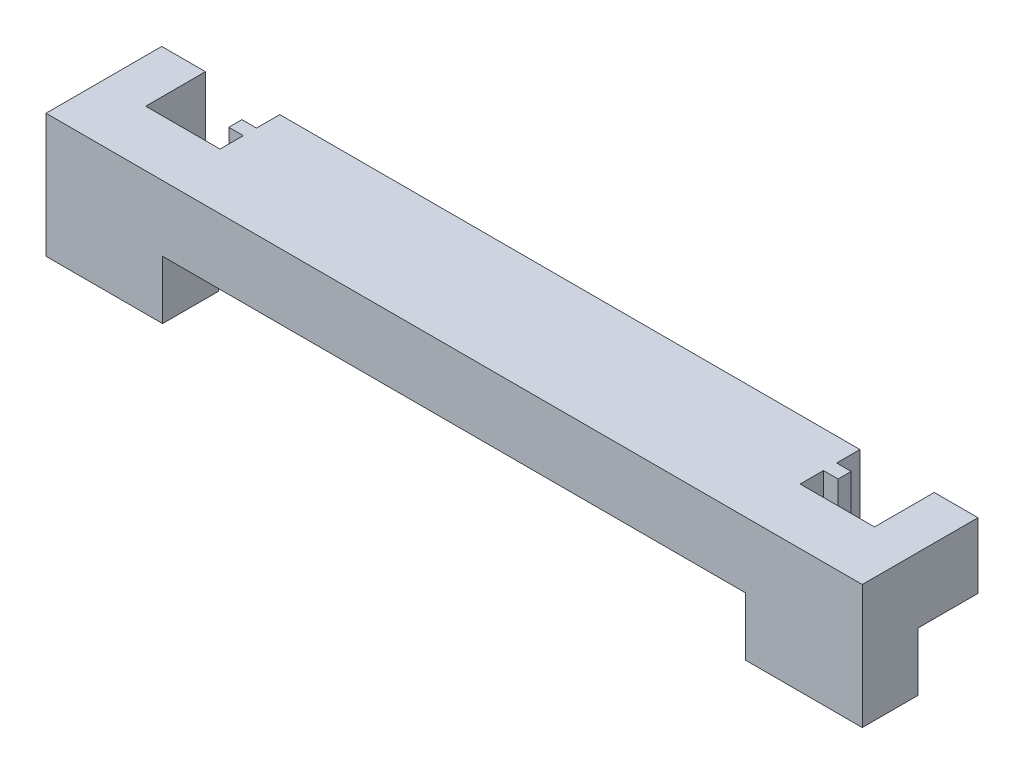
ISO-10303-21;
HEADER;
FILE_DESCRIPTION(('STEP AP214'),'2;1');
FILE_NAME('part.step','',(''),(''),'','','');
FILE_SCHEMA(('AUTOMOTIVE_DESIGN { 1 0 10303 214 1 1 1 1 }'));
ENDSEC;
DATA;
#1=APPLICATION_CONTEXT('core data for automotive mechanical design processes');
#2=APPLICATION_PROTOCOL_DEFINITION('international standard','automotive_design',2000,#1);
#3=PRODUCT_CONTEXT('',#1,'mechanical');
#4=PRODUCT('Part','Part','',(#3));
#5=PRODUCT_RELATED_PRODUCT_CATEGORY('part','',(#4));
#6=PRODUCT_DEFINITION_FORMATION('','',#4);
#7=PRODUCT_DEFINITION_CONTEXT('part definition',#1,'design');
#8=PRODUCT_DEFINITION('design','',#6,#7);
#9=PRODUCT_DEFINITION_SHAPE('','',#8);
#10=(LENGTH_UNIT() NAMED_UNIT(*) SI_UNIT(.MILLI.,.METRE.));
#11=(NAMED_UNIT(*) PLANE_ANGLE_UNIT() SI_UNIT($,.RADIAN.));
#12=(NAMED_UNIT(*) SI_UNIT($,.STERADIAN.) SOLID_ANGLE_UNIT());
#13=UNCERTAINTY_MEASURE_WITH_UNIT(LENGTH_MEASURE(1.E-05),#10,'distance_accuracy_value','');
#14=(GEOMETRIC_REPRESENTATION_CONTEXT(3) GLOBAL_UNCERTAINTY_ASSIGNED_CONTEXT((#13)) GLOBAL_UNIT_ASSIGNED_CONTEXT((#10,
#11,#12)) REPRESENTATION_CONTEXT('',''));
#15=CARTESIAN_POINT('',(0.,0.,0.));
#16=DIRECTION('',(0.,0.,1.));
#17=DIRECTION('',(1.,0.,0.));
#18=AXIS2_PLACEMENT_3D('',#15,#16,#17);
#19=CARTESIAN_POINT('',(0.,0.,0.));
#20=DIRECTION('',(0.,1.,0.));
#21=DIRECTION('',(0.,0.,1.));
#22=AXIS2_PLACEMENT_3D('',#19,#20,#21);
#23=PLANE('',#22);
#24=DIRECTION('',(0.,0.,-1.));
#25=VECTOR('',#24,1.);
#26=CARTESIAN_POINT('',(10.,0.,-1.93544009247264));
#27=LINE('',#26,#25);
#28=CARTESIAN_POINT('',(10.,0.,-0.01544009247264));
#29=VERTEX_POINT('',#28);
#30=CARTESIAN_POINT('',(10.,0.,-1.93544009247264));
#31=VERTEX_POINT('',#30);
#32=EDGE_CURVE('E209',#29,#31,#27,.T.);
#33=ORIENTED_EDGE('',*,*,#32,.F.);
#34=DIRECTION('',(1.,0.,0.));
#35=VECTOR('',#34,1.);
#36=CARTESIAN_POINT('',(0.,0.,-0.01544009247264));
#37=LINE('',#36,#35);
#38=CARTESIAN_POINT('',(-10.,0.,-0.01544009247264));
#39=VERTEX_POINT('',#38);
#40=EDGE_CURVE('E429',#39,#29,#37,.T.);
#41=ORIENTED_EDGE('',*,*,#40,.F.);
#42=DIRECTION('',(0.,0.,1.));
#43=VECTOR('',#42,1.);
#44=CARTESIAN_POINT('',(-10.,0.,-0.01544009247264));
#45=LINE('',#44,#43);
#46=CARTESIAN_POINT('',(-10.,0.,-1.93544009247264));
#47=VERTEX_POINT('',#46);
#48=EDGE_CURVE('E513',#47,#39,#45,.T.);
#49=ORIENTED_EDGE('',*,*,#48,.F.);
#50=DIRECTION('',(-1.,0.,0.));
#51=VECTOR('',#50,1.);
#52=CARTESIAN_POINT('',(0.,0.,-1.93544009247264));
#53=LINE('',#52,#51);
#54=CARTESIAN_POINT('',(-9.95,0.,-1.93544009247264));
#55=VERTEX_POINT('',#54);
#56=EDGE_CURVE('E444',#55,#47,#53,.T.);
#57=ORIENTED_EDGE('',*,*,#56,.F.);
#58=DIRECTION('',(0.,0.,1.));
#59=VECTOR('',#58,1.);
#60=CARTESIAN_POINT('',(-9.95,0.,0.));
#61=LINE('',#60,#59);
#62=CARTESIAN_POINT('',(-9.95,0.,-2.73544009247264));
#63=VERTEX_POINT('',#62);
#64=EDGE_CURVE('E312',#63,#55,#61,.T.);
#65=ORIENTED_EDGE('',*,*,#64,.F.);
#66=DIRECTION('',(1.,0.,0.));
#67=VECTOR('',#66,1.);
#68=CARTESIAN_POINT('',(-10.45,0.,-2.73544009247264));
#69=LINE('',#68,#67);
#70=CARTESIAN_POINT('',(-10.45,0.,-2.73544009247264));
#71=VERTEX_POINT('',#70);
#72=EDGE_CURVE('E306',#71,#63,#69,.T.);
#73=ORIENTED_EDGE('',*,*,#72,.F.);
#74=DIRECTION('',(0.,0.,1.));
#75=VECTOR('',#74,1.);
#76=CARTESIAN_POINT('',(-10.45,0.,-3.18544009247264));
#77=LINE('',#76,#75);
#78=CARTESIAN_POINT('',(-10.45,0.,-3.18544009247264));
#79=VERTEX_POINT('',#78);
#80=EDGE_CURVE('E289',#79,#71,#77,.T.);
#81=ORIENTED_EDGE('',*,*,#80,.F.);
#82=DIRECTION('',(1.,0.,0.));
#83=VECTOR('',#82,1.);
#84=CARTESIAN_POINT('',(-10.45,0.,-3.18544009247264));
#85=LINE('',#84,#83);
#86=CARTESIAN_POINT('',(-9.95,0.,-3.18544009247264));
#87=VERTEX_POINT('',#86);
#88=EDGE_CURVE('E301',#79,#87,#85,.T.);
#89=ORIENTED_EDGE('',*,*,#88,.T.);
#90=CARTESIAN_POINT('',(-9.95,0.,-3.98544009247264));
#91=VERTEX_POINT('',#90);
#92=EDGE_CURVE('E448',#91,#87,#61,.T.);
#93=ORIENTED_EDGE('',*,*,#92,.F.);
#94=DIRECTION('',(-1.,0.,0.));
#95=VECTOR('',#94,1.);
#96=CARTESIAN_POINT('',(0.,0.,-3.98544009247264));
#97=LINE('',#96,#95);
#98=CARTESIAN_POINT('',(9.95,0.,-3.98544009247264));
#99=VERTEX_POINT('',#98);
#100=EDGE_CURVE('E452',#99,#91,#97,.T.);
#101=ORIENTED_EDGE('',*,*,#100,.F.);
#102=DIRECTION('',(0.,0.,-1.));
#103=VECTOR('',#102,1.);
#104=CARTESIAN_POINT('',(9.95,0.,0.));
#105=LINE('',#104,#103);
#106=CARTESIAN_POINT('',(9.95,0.,-3.18544009247264));
#107=VERTEX_POINT('',#106);
#108=EDGE_CURVE('E335',#107,#99,#105,.T.);
#109=ORIENTED_EDGE('',*,*,#108,.F.);
#110=DIRECTION('',(1.,0.,0.));
#111=VECTOR('',#110,1.);
#112=CARTESIAN_POINT('',(9.45,0.,-3.18544009247264));
#113=LINE('',#112,#111);
#114=CARTESIAN_POINT('',(10.45,0.,-3.18544009247264));
#115=VERTEX_POINT('',#114);
#116=EDGE_CURVE('E341',#107,#115,#113,.T.);
#117=ORIENTED_EDGE('',*,*,#116,.T.);
#118=DIRECTION('',(0.,0.,1.));
#119=VECTOR('',#118,1.);
#120=CARTESIAN_POINT('',(10.45,0.,-3.18544009247264));
#121=LINE('',#120,#119);
#122=CARTESIAN_POINT('',(10.45,0.,-2.73544009247264));
#123=VERTEX_POINT('',#122);
#124=EDGE_CURVE('E345',#115,#123,#121,.T.);
#125=ORIENTED_EDGE('',*,*,#124,.T.);
#126=DIRECTION('',(1.,0.,0.));
#127=VECTOR('',#126,1.);
#128=CARTESIAN_POINT('',(9.45,0.,-2.73544009247264));
#129=LINE('',#128,#127);
#130=CARTESIAN_POINT('',(9.95,0.,-2.73544009247264));
#131=VERTEX_POINT('',#130);
#132=EDGE_CURVE('E349',#131,#123,#129,.T.);
#133=ORIENTED_EDGE('',*,*,#132,.F.);
#134=CARTESIAN_POINT('',(9.95,0.,-1.93544009247264));
#135=VERTEX_POINT('',#134);
#136=EDGE_CURVE('E418',#135,#131,#105,.T.);
#137=ORIENTED_EDGE('',*,*,#136,.F.);
#138=DIRECTION('',(-1.,0.,0.));
#139=VECTOR('',#138,1.);
#140=CARTESIAN_POINT('',(0.,0.,-1.93544009247264));
#141=LINE('',#140,#139);
#142=EDGE_CURVE('E415',#31,#135,#141,.T.);
#143=ORIENTED_EDGE('',*,*,#142,.F.);
#144=EDGE_LOOP('',(#33,#41,#49,#57,#65,#73,#81,#89,#93,#101,#109,#117,#125,#133,#137,#143));
#145=FACE_BOUND('',#144,.T.);
#146=ADVANCED_FACE('F191',(#145),#23,.F.);
#147=DIRECTION('',(1.,0.,0.));
#148=VECTOR('',#147,1.);
#149=CARTESIAN_POINT('',(10.,0.,-1.93544009247264));
#150=LINE('',#149,#148);
#151=CARTESIAN_POINT('',(12.5,0.,-1.93544009247264));
#152=VERTEX_POINT('',#151);
#153=CARTESIAN_POINT('',(14.,0.,-1.93544009247264));
#154=VERTEX_POINT('',#153);
#155=EDGE_CURVE('E539',#152,#154,#150,.T.);
#156=ORIENTED_EDGE('',*,*,#155,.F.);
#157=DIRECTION('',(0.,0.,1.));
#158=VECTOR('',#157,1.);
#159=CARTESIAN_POINT('',(12.5,0.,0.));
#160=LINE('',#159,#158);
#161=CARTESIAN_POINT('',(12.5,0.,-3.98544009247264));
#162=VERTEX_POINT('',#161);
#163=EDGE_CURVE('E419',#162,#152,#160,.T.);
#164=ORIENTED_EDGE('',*,*,#163,.F.);
#165=DIRECTION('',(-1.,0.,0.));
#166=VECTOR('',#165,1.);
#167=CARTESIAN_POINT('',(0.,0.,-3.98544009247264));
#168=LINE('',#167,#166);
#169=CARTESIAN_POINT('',(14.,0.,-3.98544009247264));
#170=VERTEX_POINT('',#169);
#171=EDGE_CURVE('E423',#170,#162,#168,.T.);
#172=ORIENTED_EDGE('',*,*,#171,.F.);
#173=DIRECTION('',(0.,0.,-1.));
#174=VECTOR('',#173,1.);
#175=CARTESIAN_POINT('',(14.,0.,0.));
#176=LINE('',#175,#174);
#177=EDGE_CURVE('E426',#154,#170,#176,.T.);
#178=ORIENTED_EDGE('',*,*,#177,.F.);
#179=EDGE_LOOP('',(#156,#164,#172,#178));
#180=FACE_BOUND('',#179,.T.);
#181=ADVANCED_FACE('F711',(#180),#23,.F.);
#182=DIRECTION('',(1.,0.,0.));
#183=VECTOR('',#182,1.);
#184=CARTESIAN_POINT('',(-14.,0.,-1.93544009247264));
#185=LINE('',#184,#183);
#186=CARTESIAN_POINT('',(-14.,0.,-1.93544009247264));
#187=VERTEX_POINT('',#186);
#188=CARTESIAN_POINT('',(-12.5,0.,-1.93544009247264));
#189=VERTEX_POINT('',#188);
#190=EDGE_CURVE('E518',#187,#189,#185,.T.);
#191=ORIENTED_EDGE('',*,*,#190,.F.);
#192=DIRECTION('',(0.,0.,-1.));
#193=VECTOR('',#192,1.);
#194=CARTESIAN_POINT('',(-14.,0.,0.));
#195=LINE('',#194,#193);
#196=CARTESIAN_POINT('',(-14.,0.,-3.98544009247264));
#197=VERTEX_POINT('',#196);
#198=EDGE_CURVE('E433',#187,#197,#195,.T.);
#199=ORIENTED_EDGE('',*,*,#198,.T.);
#200=DIRECTION('',(1.,0.,0.));
#201=VECTOR('',#200,1.);
#202=CARTESIAN_POINT('',(0.,0.,-3.98544009247264));
#203=LINE('',#202,#201);
#204=CARTESIAN_POINT('',(-12.5,0.,-3.98544009247264));
#205=VERTEX_POINT('',#204);
#206=EDGE_CURVE('E436',#197,#205,#203,.T.);
#207=ORIENTED_EDGE('',*,*,#206,.T.);
#208=DIRECTION('',(0.,0.,1.));
#209=VECTOR('',#208,1.);
#210=CARTESIAN_POINT('',(-12.5,0.,0.));
#211=LINE('',#210,#209);
#212=EDGE_CURVE('E440',#205,#189,#211,.T.);
#213=ORIENTED_EDGE('',*,*,#212,.T.);
#214=EDGE_LOOP('',(#191,#199,#207,#213));
#215=FACE_BOUND('',#214,.T.);
#216=ADVANCED_FACE('F626',(#215),#23,.F.);
#217=CARTESIAN_POINT('',(9.95,2.25,0.));
#218=DIRECTION('',(-1.,0.,0.));
#219=DIRECTION('',(0.,0.,1.));
#220=AXIS2_PLACEMENT_3D('',#217,#218,#219);
#221=PLANE('',#220);
#222=ORIENTED_EDGE('',*,*,#108,.T.);
#223=DIRECTION('',(0.,-1.,0.));
#224=VECTOR('',#223,1.);
#225=CARTESIAN_POINT('',(9.95,2.25,-3.98544009247264));
#226=LINE('',#225,#224);
#227=CARTESIAN_POINT('',(9.95,2.25,-3.98544009247264));
#228=VERTEX_POINT('',#227);
#229=EDGE_CURVE('E201',#228,#99,#226,.T.);
#230=ORIENTED_EDGE('',*,*,#229,.F.);
#231=DIRECTION('',(0.,0.,-1.));
#232=VECTOR('',#231,1.);
#233=CARTESIAN_POINT('',(9.95,2.25,0.));
#234=LINE('',#233,#232);
#235=CARTESIAN_POINT('',(9.95,2.25,-3.18544009247264));
#236=VERTEX_POINT('',#235);
#237=EDGE_CURVE('E501',#236,#228,#234,.T.);
#238=ORIENTED_EDGE('',*,*,#237,.F.);
#239=DIRECTION('',(0.,-1.,0.));
#240=VECTOR('',#239,1.);
#241=CARTESIAN_POINT('',(9.95,2.25,-3.18544009247264));
#242=LINE('',#241,#240);
#243=EDGE_CURVE('E12',#236,#107,#242,.T.);
#244=ORIENTED_EDGE('',*,*,#243,.T.);
#245=EDGE_LOOP('',(#222,#230,#238,#244));
#246=FACE_BOUND('',#245,.T.);
#247=ADVANCED_FACE('F720',(#246),#221,.F.);
#248=CARTESIAN_POINT('',(0.,2.25,-3.98544009247264));
#249=DIRECTION('',(0.,0.,1.));
#250=DIRECTION('',(1.,0.,0.));
#251=AXIS2_PLACEMENT_3D('',#248,#249,#250);
#252=PLANE('',#251);
#253=ORIENTED_EDGE('',*,*,#100,.T.);
#254=DIRECTION('',(0.,-1.,0.));
#255=VECTOR('',#254,1.);
#256=CARTESIAN_POINT('',(-9.95,2.25,-3.98544009247264));
#257=LINE('',#256,#255);
#258=CARTESIAN_POINT('',(-9.95,2.25,-3.98544009247264));
#259=VERTEX_POINT('',#258);
#260=EDGE_CURVE('E363',#259,#91,#257,.T.);
#261=ORIENTED_EDGE('',*,*,#260,.F.);
#262=DIRECTION('',(-1.,0.,0.));
#263=VECTOR('',#262,1.);
#264=CARTESIAN_POINT('',(0.,2.25,-3.98544009247264));
#265=LINE('',#264,#263);
#266=EDGE_CURVE('E497',#228,#259,#265,.T.);
#267=ORIENTED_EDGE('',*,*,#266,.F.);
#268=ORIENTED_EDGE('',*,*,#229,.T.);
#269=EDGE_LOOP('',(#253,#261,#267,#268));
#270=FACE_BOUND('',#269,.T.);
#271=ADVANCED_FACE('F725',(#270),#252,.F.);
#272=CARTESIAN_POINT('',(-9.95,2.25,0.));
#273=DIRECTION('',(1.,0.,0.));
#274=DIRECTION('',(0.,0.,-1.));
#275=AXIS2_PLACEMENT_3D('',#272,#273,#274);
#276=PLANE('',#275);
#277=ORIENTED_EDGE('',*,*,#92,.T.);
#278=DIRECTION('',(0.,-1.,0.));
#279=VECTOR('',#278,1.);
#280=CARTESIAN_POINT('',(-9.95,2.25,-3.18544009247264));
#281=LINE('',#280,#279);
#282=CARTESIAN_POINT('',(-9.95,2.25,-3.18544009247264));
#283=VERTEX_POINT('',#282);
#284=EDGE_CURVE('E367',#283,#87,#281,.T.);
#285=ORIENTED_EDGE('',*,*,#284,.F.);
#286=DIRECTION('',(0.,0.,1.));
#287=VECTOR('',#286,1.);
#288=CARTESIAN_POINT('',(-9.95,2.25,0.));
#289=LINE('',#288,#287);
#290=EDGE_CURVE('E493',#259,#283,#289,.T.);
#291=ORIENTED_EDGE('',*,*,#290,.F.);
#292=ORIENTED_EDGE('',*,*,#260,.T.);
#293=EDGE_LOOP('',(#277,#285,#291,#292));
#294=FACE_BOUND('',#293,.T.);
#295=ADVANCED_FACE('F749',(#294),#276,.F.);
#296=ORIENTED_EDGE('',*,*,#64,.T.);
#297=DIRECTION('',(0.,-1.,0.));
#298=VECTOR('',#297,1.);
#299=CARTESIAN_POINT('',(-9.95,2.25,-1.93544009247264));
#300=LINE('',#299,#298);
#301=CARTESIAN_POINT('',(-9.95,2.25,-1.93544009247264));
#302=VERTEX_POINT('',#301);
#303=EDGE_CURVE('E373',#302,#55,#300,.T.);
#304=ORIENTED_EDGE('',*,*,#303,.F.);
#305=CARTESIAN_POINT('',(-9.95,2.25,-2.73544009247264));
#306=VERTEX_POINT('',#305);
#307=EDGE_CURVE('E492',#306,#302,#289,.T.);
#308=ORIENTED_EDGE('',*,*,#307,.F.);
#309=DIRECTION('',(0.,-1.,0.));
#310=VECTOR('',#309,1.);
#311=CARTESIAN_POINT('',(-9.95,2.25,-2.73544009247264));
#312=LINE('',#311,#310);
#313=EDGE_CURVE('E370',#306,#63,#312,.T.);
#314=ORIENTED_EDGE('',*,*,#313,.T.);
#315=EDGE_LOOP('',(#296,#304,#308,#314));
#316=FACE_BOUND('',#315,.T.);
#317=ADVANCED_FACE('F583',(#316),#276,.F.);
#318=CARTESIAN_POINT('',(0.,2.25,-1.93544009247264));
#319=DIRECTION('',(0.,0.,1.));
#320=DIRECTION('',(1.,0.,0.));
#321=AXIS2_PLACEMENT_3D('',#318,#319,#320);
#322=PLANE('',#321);
#323=ORIENTED_EDGE('',*,*,#56,.T.);
#324=DIRECTION('',(0.,1.,0.));
#325=VECTOR('',#324,1.);
#326=CARTESIAN_POINT('',(-10.,-2.,-1.93544009247264));
#327=LINE('',#326,#325);
#328=CARTESIAN_POINT('',(-10.,-2.,-1.93544009247264));
#329=VERTEX_POINT('',#328);
#330=EDGE_CURVE('E320',#329,#47,#327,.T.);
#331=ORIENTED_EDGE('',*,*,#330,.F.);
#332=DIRECTION('',(1.,0.,0.));
#333=VECTOR('',#332,1.);
#334=CARTESIAN_POINT('',(-14.,-2.,-1.93544009247264));
#335=LINE('',#334,#333);
#336=CARTESIAN_POINT('',(-14.,-2.,-1.93544009247264));
#337=VERTEX_POINT('',#336);
#338=EDGE_CURVE('E528',#337,#329,#335,.T.);
#339=ORIENTED_EDGE('',*,*,#338,.F.);
#340=DIRECTION('',(0.,1.,0.));
#341=VECTOR('',#340,1.);
#342=CARTESIAN_POINT('',(-14.,-2.,-1.93544009247264));
#343=LINE('',#342,#341);
#344=EDGE_CURVE('E314',#337,#187,#343,.T.);
#345=ORIENTED_EDGE('',*,*,#344,.T.);
#346=ORIENTED_EDGE('',*,*,#190,.T.);
#347=DIRECTION('',(0.,-1.,0.));
#348=VECTOR('',#347,1.);
#349=CARTESIAN_POINT('',(-12.5,2.25,-1.93544009247264));
#350=LINE('',#349,#348);
#351=CARTESIAN_POINT('',(-12.5,2.25,-1.93544009247264));
#352=VERTEX_POINT('',#351);
#353=EDGE_CURVE('E377',#352,#189,#350,.T.);
#354=ORIENTED_EDGE('',*,*,#353,.F.);
#355=DIRECTION('',(-1.,0.,0.));
#356=VECTOR('',#355,1.);
#357=CARTESIAN_POINT('',(0.,2.25,-1.93544009247264));
#358=LINE('',#357,#356);
#359=EDGE_CURVE('E488',#302,#352,#358,.T.);
#360=ORIENTED_EDGE('',*,*,#359,.F.);
#361=ORIENTED_EDGE('',*,*,#303,.T.);
#362=EDGE_LOOP('',(#323,#331,#339,#345,#346,#354,#360,#361));
#363=FACE_BOUND('',#362,.T.);
#364=ADVANCED_FACE('F588',(#363),#322,.F.);
#365=CARTESIAN_POINT('',(-12.5,2.25,0.));
#366=DIRECTION('',(1.,0.,0.));
#367=DIRECTION('',(0.,0.,-1.));
#368=AXIS2_PLACEMENT_3D('',#365,#366,#367);
#369=PLANE('',#368);
#370=ORIENTED_EDGE('',*,*,#212,.F.);
#371=DIRECTION('',(0.,-1.,0.));
#372=VECTOR('',#371,1.);
#373=CARTESIAN_POINT('',(-12.5,2.25,-3.98544009247264));
#374=LINE('',#373,#372);
#375=CARTESIAN_POINT('',(-12.5,2.25,-3.98544009247264));
#376=VERTEX_POINT('',#375);
#377=EDGE_CURVE('E381',#376,#205,#374,.T.);
#378=ORIENTED_EDGE('',*,*,#377,.F.);
#379=DIRECTION('',(0.,0.,1.));
#380=VECTOR('',#379,1.);
#381=CARTESIAN_POINT('',(-12.5,2.25,0.));
#382=LINE('',#381,#380);
#383=EDGE_CURVE('E484',#376,#352,#382,.T.);
#384=ORIENTED_EDGE('',*,*,#383,.T.);
#385=ORIENTED_EDGE('',*,*,#353,.T.);
#386=EDGE_LOOP('',(#370,#378,#384,#385));
#387=FACE_BOUND('',#386,.T.);
#388=ADVANCED_FACE('F631',(#387),#369,.T.);
#389=CARTESIAN_POINT('',(0.,2.25,-3.98544009247264));
#390=DIRECTION('',(0.,0.,-1.));
#391=DIRECTION('',(-1.,0.,0.));
#392=AXIS2_PLACEMENT_3D('',#389,#390,#391);
#393=PLANE('',#392);
#394=ORIENTED_EDGE('',*,*,#206,.F.);
#395=DIRECTION('',(0.,-1.,0.));
#396=VECTOR('',#395,1.);
#397=CARTESIAN_POINT('',(-14.,2.25,-3.98544009247264));
#398=LINE('',#397,#396);
#399=CARTESIAN_POINT('',(-14.,2.25,-3.98544009247264));
#400=VERTEX_POINT('',#399);
#401=EDGE_CURVE('E384',#400,#197,#398,.T.);
#402=ORIENTED_EDGE('',*,*,#401,.F.);
#403=DIRECTION('',(1.,0.,0.));
#404=VECTOR('',#403,1.);
#405=CARTESIAN_POINT('',(0.,2.25,-3.98544009247264));
#406=LINE('',#405,#404);
#407=EDGE_CURVE('E480',#400,#376,#406,.T.);
#408=ORIENTED_EDGE('',*,*,#407,.T.);
#409=ORIENTED_EDGE('',*,*,#377,.T.);
#410=EDGE_LOOP('',(#394,#402,#408,#409));
#411=FACE_BOUND('',#410,.T.);
#412=ADVANCED_FACE('F701',(#411),#393,.T.);
#413=CARTESIAN_POINT('',(-14.,2.25,0.));
#414=DIRECTION('',(-1.,0.,0.));
#415=DIRECTION('',(0.,0.,1.));
#416=AXIS2_PLACEMENT_3D('',#413,#414,#415);
#417=PLANE('',#416);
#418=ORIENTED_EDGE('',*,*,#198,.F.);
#419=ORIENTED_EDGE('',*,*,#344,.F.);
#420=DIRECTION('',(0.,0.,-1.));
#421=VECTOR('',#420,1.);
#422=CARTESIAN_POINT('',(-14.,-2.,-0.01544009247264));
#423=LINE('',#422,#421);
#424=CARTESIAN_POINT('',(-14.,-2.,-0.01544009247264));
#425=VERTEX_POINT('',#424);
#426=EDGE_CURVE('E517',#425,#337,#423,.T.);
#427=ORIENTED_EDGE('',*,*,#426,.F.);
#428=DIRECTION('',(0.,-1.,0.));
#429=VECTOR('',#428,1.);
#430=CARTESIAN_POINT('',(-14.,2.25,-0.01544009247264));
#431=LINE('',#430,#429);
#432=CARTESIAN_POINT('',(-14.,2.25,-0.01544009247264));
#433=VERTEX_POINT('',#432);
#434=EDGE_CURVE('E388',#433,#425,#431,.T.);
#435=ORIENTED_EDGE('',*,*,#434,.F.);
#436=DIRECTION('',(0.,0.,-1.));
#437=VECTOR('',#436,1.);
#438=CARTESIAN_POINT('',(-14.,2.25,0.));
#439=LINE('',#438,#437);
#440=EDGE_CURVE('E476',#433,#400,#439,.T.);
#441=ORIENTED_EDGE('',*,*,#440,.T.);
#442=ORIENTED_EDGE('',*,*,#401,.T.);
#443=EDGE_LOOP('',(#418,#419,#427,#435,#441,#442));
#444=FACE_BOUND('',#443,.T.);
#445=ADVANCED_FACE('F618',(#444),#417,.T.);
#446=CARTESIAN_POINT('',(0.,2.25,-0.01544009247264));
#447=DIRECTION('',(0.,0.,-1.));
#448=DIRECTION('',(-1.,0.,0.));
#449=AXIS2_PLACEMENT_3D('',#446,#447,#448);
#450=PLANE('',#449);
#451=ORIENTED_EDGE('',*,*,#434,.T.);
#452=DIRECTION('',(-1.,0.,0.));
#453=VECTOR('',#452,1.);
#454=CARTESIAN_POINT('',(-14.,-2.,-0.01544009247264));
#455=LINE('',#454,#453);
#456=CARTESIAN_POINT('',(-10.,-2.,-0.01544009247264));
#457=VERTEX_POINT('',#456);
#458=EDGE_CURVE('E512',#457,#425,#455,.T.);
#459=ORIENTED_EDGE('',*,*,#458,.F.);
#460=DIRECTION('',(0.,1.,0.));
#461=VECTOR('',#460,1.);
#462=CARTESIAN_POINT('',(-10.,-2.,-0.01544009247264));
#463=LINE('',#462,#461);
#464=EDGE_CURVE('E508',#457,#39,#463,.T.);
#465=ORIENTED_EDGE('',*,*,#464,.T.);
#466=ORIENTED_EDGE('',*,*,#40,.T.);
#467=DIRECTION('',(0.,1.,0.));
#468=VECTOR('',#467,1.);
#469=CARTESIAN_POINT('',(10.,-2.,-0.01544009247264));
#470=LINE('',#469,#468);
#471=CARTESIAN_POINT('',(10.,-2.,-0.01544009247264));
#472=VERTEX_POINT('',#471);
#473=EDGE_CURVE('E552',#472,#29,#470,.T.);
#474=ORIENTED_EDGE('',*,*,#473,.F.);
#475=DIRECTION('',(-1.,0.,0.));
#476=VECTOR('',#475,1.);
#477=CARTESIAN_POINT('',(10.,-2.,-0.01544009247264));
#478=LINE('',#477,#476);
#479=CARTESIAN_POINT('',(14.,-2.,-0.01544009247264));
#480=VERTEX_POINT('',#479);
#481=EDGE_CURVE('E548',#480,#472,#478,.T.);
#482=ORIENTED_EDGE('',*,*,#481,.F.);
#483=DIRECTION('',(0.,-1.,0.));
#484=VECTOR('',#483,1.);
#485=CARTESIAN_POINT('',(14.,2.25,-0.01544009247264));
#486=LINE('',#485,#484);
#487=CARTESIAN_POINT('',(14.,2.25,-0.01544009247264));
#488=VERTEX_POINT('',#487);
#489=EDGE_CURVE('E392',#488,#480,#486,.T.);
#490=ORIENTED_EDGE('',*,*,#489,.F.);
#491=DIRECTION('',(1.,0.,0.));
#492=VECTOR('',#491,1.);
#493=CARTESIAN_POINT('',(0.,2.25,-0.01544009247264));
#494=LINE('',#493,#492);
#495=EDGE_CURVE('E472',#433,#488,#494,.T.);
#496=ORIENTED_EDGE('',*,*,#495,.F.);
#497=EDGE_LOOP('',(#451,#459,#465,#466,#474,#482,#490,#496));
#498=FACE_BOUND('',#497,.T.);
#499=ADVANCED_FACE('F605',(#498),#450,.F.);
#500=CARTESIAN_POINT('',(14.,2.25,0.));
#501=DIRECTION('',(-1.,0.,0.));
#502=DIRECTION('',(0.,0.,1.));
#503=AXIS2_PLACEMENT_3D('',#500,#501,#502);
#504=PLANE('',#503);
#505=ORIENTED_EDGE('',*,*,#489,.T.);
#506=DIRECTION('',(0.,0.,1.));
#507=VECTOR('',#506,1.);
#508=CARTESIAN_POINT('',(14.,-2.,-1.93544009247264));
#509=LINE('',#508,#507);
#510=CARTESIAN_POINT('',(14.,-2.,-1.93544009247264));
#511=VERTEX_POINT('',#510);
#512=EDGE_CURVE('E544',#511,#480,#509,.T.);
#513=ORIENTED_EDGE('',*,*,#512,.F.);
#514=DIRECTION('',(0.,1.,0.));
#515=VECTOR('',#514,1.);
#516=CARTESIAN_POINT('',(14.,-2.,-1.93544009247264));
#517=LINE('',#516,#515);
#518=EDGE_CURVE('E560',#511,#154,#517,.T.);
#519=ORIENTED_EDGE('',*,*,#518,.T.);
#520=ORIENTED_EDGE('',*,*,#177,.T.);
#521=DIRECTION('',(0.,-1.,0.));
#522=VECTOR('',#521,1.);
#523=CARTESIAN_POINT('',(14.,2.25,-3.98544009247264));
#524=LINE('',#523,#522);
#525=CARTESIAN_POINT('',(14.,2.25,-3.98544009247264));
#526=VERTEX_POINT('',#525);
#527=EDGE_CURVE('E396',#526,#170,#524,.T.);
#528=ORIENTED_EDGE('',*,*,#527,.F.);
#529=DIRECTION('',(0.,0.,-1.));
#530=VECTOR('',#529,1.);
#531=CARTESIAN_POINT('',(14.,2.25,0.));
#532=LINE('',#531,#530);
#533=EDGE_CURVE('E468',#488,#526,#532,.T.);
#534=ORIENTED_EDGE('',*,*,#533,.F.);
#535=EDGE_LOOP('',(#505,#513,#519,#520,#528,#534));
#536=FACE_BOUND('',#535,.T.);
#537=ADVANCED_FACE('F695',(#536),#504,.F.);
#538=CARTESIAN_POINT('',(0.,2.25,-3.98544009247264));
#539=DIRECTION('',(0.,0.,1.));
#540=DIRECTION('',(1.,0.,0.));
#541=AXIS2_PLACEMENT_3D('',#538,#539,#540);
#542=PLANE('',#541);
#543=ORIENTED_EDGE('',*,*,#171,.T.);
#544=DIRECTION('',(0.,-1.,0.));
#545=VECTOR('',#544,1.);
#546=CARTESIAN_POINT('',(12.5,2.25,-3.98544009247264));
#547=LINE('',#546,#545);
#548=CARTESIAN_POINT('',(12.5,2.25,-3.98544009247264));
#549=VERTEX_POINT('',#548);
#550=EDGE_CURVE('E400',#549,#162,#547,.T.);
#551=ORIENTED_EDGE('',*,*,#550,.F.);
#552=DIRECTION('',(-1.,0.,0.));
#553=VECTOR('',#552,1.);
#554=CARTESIAN_POINT('',(0.,2.25,-3.98544009247264));
#555=LINE('',#554,#553);
#556=EDGE_CURVE('E464',#526,#549,#555,.T.);
#557=ORIENTED_EDGE('',*,*,#556,.F.);
#558=ORIENTED_EDGE('',*,*,#527,.T.);
#559=EDGE_LOOP('',(#543,#551,#557,#558));
#560=FACE_BOUND('',#559,.T.);
#561=ADVANCED_FACE('F792',(#560),#542,.F.);
#562=CARTESIAN_POINT('',(12.5,2.25,0.));
#563=DIRECTION('',(1.,0.,0.));
#564=DIRECTION('',(0.,0.,-1.));
#565=AXIS2_PLACEMENT_3D('',#562,#563,#564);
#566=PLANE('',#565);
#567=ORIENTED_EDGE('',*,*,#163,.T.);
#568=DIRECTION('',(0.,-1.,0.));
#569=VECTOR('',#568,1.);
#570=CARTESIAN_POINT('',(12.5,2.25,-1.93544009247264));
#571=LINE('',#570,#569);
#572=CARTESIAN_POINT('',(12.5,2.25,-1.93544009247264));
#573=VERTEX_POINT('',#572);
#574=EDGE_CURVE('E404',#573,#152,#571,.T.);
#575=ORIENTED_EDGE('',*,*,#574,.F.);
#576=DIRECTION('',(0.,0.,1.));
#577=VECTOR('',#576,1.);
#578=CARTESIAN_POINT('',(12.5,2.25,0.));
#579=LINE('',#578,#577);
#580=EDGE_CURVE('E460',#549,#573,#579,.T.);
#581=ORIENTED_EDGE('',*,*,#580,.F.);
#582=ORIENTED_EDGE('',*,*,#550,.T.);
#583=EDGE_LOOP('',(#567,#575,#581,#582));
#584=FACE_BOUND('',#583,.T.);
#585=ADVANCED_FACE('F660',(#584),#566,.F.);
#586=CARTESIAN_POINT('',(0.,2.25,-1.93544009247264));
#587=DIRECTION('',(0.,0.,1.));
#588=DIRECTION('',(1.,0.,0.));
#589=AXIS2_PLACEMENT_3D('',#586,#587,#588);
#590=PLANE('',#589);
#591=ORIENTED_EDGE('',*,*,#574,.T.);
#592=ORIENTED_EDGE('',*,*,#155,.T.);
#593=ORIENTED_EDGE('',*,*,#518,.F.);
#594=DIRECTION('',(1.,0.,0.));
#595=VECTOR('',#594,1.);
#596=CARTESIAN_POINT('',(10.,-2.,-1.93544009247264));
#597=LINE('',#596,#595);
#598=CARTESIAN_POINT('',(10.,-2.,-1.93544009247264));
#599=VERTEX_POINT('',#598);
#600=EDGE_CURVE('E540',#599,#511,#597,.T.);
#601=ORIENTED_EDGE('',*,*,#600,.F.);
#602=DIRECTION('',(0.,1.,0.));
#603=VECTOR('',#602,1.);
#604=CARTESIAN_POINT('',(10.,-2.,-1.93544009247264));
#605=LINE('',#604,#603);
#606=EDGE_CURVE('E564',#599,#31,#605,.T.);
#607=ORIENTED_EDGE('',*,*,#606,.T.);
#608=ORIENTED_EDGE('',*,*,#142,.T.);
#609=DIRECTION('',(0.,-1.,0.));
#610=VECTOR('',#609,1.);
#611=CARTESIAN_POINT('',(9.95,2.25,-1.93544009247264));
#612=LINE('',#611,#610);
#613=CARTESIAN_POINT('',(9.95,2.25,-1.93544009247264));
#614=VERTEX_POINT('',#613);
#615=EDGE_CURVE('E408',#614,#135,#612,.T.);
#616=ORIENTED_EDGE('',*,*,#615,.F.);
#617=DIRECTION('',(-1.,0.,0.));
#618=VECTOR('',#617,1.);
#619=CARTESIAN_POINT('',(0.,2.25,-1.93544009247264));
#620=LINE('',#619,#618);
#621=EDGE_CURVE('E457',#573,#614,#620,.T.);
#622=ORIENTED_EDGE('',*,*,#621,.F.);
#623=EDGE_LOOP('',(#591,#592,#593,#601,#607,#608,#616,#622));
#624=FACE_BOUND('',#623,.T.);
#625=ADVANCED_FACE('F569',(#624),#590,.F.);
#626=ORIENTED_EDGE('',*,*,#136,.T.);
#627=DIRECTION('',(0.,-1.,0.));
#628=VECTOR('',#627,1.);
#629=CARTESIAN_POINT('',(9.95,2.25,-2.73544009247264));
#630=LINE('',#629,#628);
#631=CARTESIAN_POINT('',(9.95,2.25,-2.73544009247264));
#632=VERTEX_POINT('',#631);
#633=EDGE_CURVE('E218',#632,#131,#630,.T.);
#634=ORIENTED_EDGE('',*,*,#633,.F.);
#635=EDGE_CURVE('E414',#614,#632,#234,.T.);
#636=ORIENTED_EDGE('',*,*,#635,.F.);
#637=ORIENTED_EDGE('',*,*,#615,.T.);
#638=EDGE_LOOP('',(#626,#634,#636,#637));
#639=FACE_BOUND('',#638,.T.);
#640=ADVANCED_FACE('F662',(#639),#221,.F.);
#641=CARTESIAN_POINT('',(0.,2.25,0.));
#642=DIRECTION('',(0.,1.,0.));
#643=DIRECTION('',(0.,0.,1.));
#644=AXIS2_PLACEMENT_3D('',#641,#642,#643);
#645=PLANE('',#644);
#646=ORIENTED_EDGE('',*,*,#635,.T.);
#647=DIRECTION('',(1.,0.,0.));
#648=VECTOR('',#647,1.);
#649=CARTESIAN_POINT('',(9.45,2.25,-2.73544009247264));
#650=LINE('',#649,#648);
#651=CARTESIAN_POINT('',(10.45,2.25,-2.73544009247264));
#652=VERTEX_POINT('',#651);
#653=EDGE_CURVE('E344',#632,#652,#650,.T.);
#654=ORIENTED_EDGE('',*,*,#653,.T.);
#655=DIRECTION('',(0.,0.,1.));
#656=VECTOR('',#655,1.);
#657=CARTESIAN_POINT('',(10.45,2.25,-3.18544009247264));
#658=LINE('',#657,#656);
#659=CARTESIAN_POINT('',(10.45,2.25,-3.18544009247264));
#660=VERTEX_POINT('',#659);
#661=EDGE_CURVE('E354',#660,#652,#658,.T.);
#662=ORIENTED_EDGE('',*,*,#661,.F.);
#663=DIRECTION('',(1.,0.,0.));
#664=VECTOR('',#663,1.);
#665=CARTESIAN_POINT('',(9.45,2.25,-3.18544009247264));
#666=LINE('',#665,#664);
#667=EDGE_CURVE('E340',#236,#660,#666,.T.);
#668=ORIENTED_EDGE('',*,*,#667,.F.);
#669=ORIENTED_EDGE('',*,*,#237,.T.);
#670=ORIENTED_EDGE('',*,*,#266,.T.);
#671=ORIENTED_EDGE('',*,*,#290,.T.);
#672=DIRECTION('',(1.,0.,0.));
#673=VECTOR('',#672,1.);
#674=CARTESIAN_POINT('',(-10.45,2.25,-3.18544009247264));
#675=LINE('',#674,#673);
#676=CARTESIAN_POINT('',(-10.45,2.25,-3.18544009247264));
#677=VERTEX_POINT('',#676);
#678=EDGE_CURVE('E325',#677,#283,#675,.T.);
#679=ORIENTED_EDGE('',*,*,#678,.F.);
#680=DIRECTION('',(0.,0.,1.));
#681=VECTOR('',#680,1.);
#682=CARTESIAN_POINT('',(-10.45,2.25,-3.18544009247264));
#683=LINE('',#682,#681);
#684=CARTESIAN_POINT('',(-10.45,2.25,-2.73544009247264));
#685=VERTEX_POINT('',#684);
#686=EDGE_CURVE('E310',#677,#685,#683,.T.);
#687=ORIENTED_EDGE('',*,*,#686,.T.);
#688=DIRECTION('',(1.,0.,0.));
#689=VECTOR('',#688,1.);
#690=CARTESIAN_POINT('',(-10.45,2.25,-2.73544009247264));
#691=LINE('',#690,#689);
#692=EDGE_CURVE('E300',#685,#306,#691,.T.);
#693=ORIENTED_EDGE('',*,*,#692,.T.);
#694=ORIENTED_EDGE('',*,*,#307,.T.);
#695=ORIENTED_EDGE('',*,*,#359,.T.);
#696=ORIENTED_EDGE('',*,*,#383,.F.);
#697=ORIENTED_EDGE('',*,*,#407,.F.);
#698=ORIENTED_EDGE('',*,*,#440,.F.);
#699=ORIENTED_EDGE('',*,*,#495,.T.);
#700=ORIENTED_EDGE('',*,*,#533,.T.);
#701=ORIENTED_EDGE('',*,*,#556,.T.);
#702=ORIENTED_EDGE('',*,*,#580,.T.);
#703=ORIENTED_EDGE('',*,*,#621,.T.);
#704=EDGE_LOOP('',(#646,#654,#662,#668,#669,#670,#671,#679,#687,#693,#694,#695,#696,#697,#698,
#699,#700,#701,#702,#703));
#705=FACE_BOUND('',#704,.T.);
#706=ADVANCED_FACE('F655',(#705),#645,.T.);
#707=CARTESIAN_POINT('',(-10.45,2.25,-3.18544009247264));
#708=DIRECTION('',(0.,0.,-1.));
#709=DIRECTION('',(-1.,0.,0.));
#710=AXIS2_PLACEMENT_3D('',#707,#708,#709);
#711=PLANE('',#710);
#712=ORIENTED_EDGE('',*,*,#678,.T.);
#713=ORIENTED_EDGE('',*,*,#284,.T.);
#714=ORIENTED_EDGE('',*,*,#88,.F.);
#715=DIRECTION('',(0.,-1.,0.));
#716=VECTOR('',#715,1.);
#717=CARTESIAN_POINT('',(-10.45,2.25,-3.18544009247264));
#718=LINE('',#717,#716);
#719=EDGE_CURVE('E195',#677,#79,#718,.T.);
#720=ORIENTED_EDGE('',*,*,#719,.F.);
#721=EDGE_LOOP('',(#712,#713,#714,#720));
#722=FACE_BOUND('',#721,.T.);
#723=ADVANCED_FACE('F721',(#722),#711,.T.);
#724=CARTESIAN_POINT('',(-10.45,2.25,-3.18544009247264));
#725=DIRECTION('',(1.,0.,0.));
#726=DIRECTION('',(0.,0.,-1.));
#727=AXIS2_PLACEMENT_3D('',#724,#725,#726);
#728=PLANE('',#727);
#729=ORIENTED_EDGE('',*,*,#80,.T.);
#730=DIRECTION('',(0.,-1.,0.));
#731=VECTOR('',#730,1.);
#732=CARTESIAN_POINT('',(-10.45,2.25,-2.73544009247264));
#733=LINE('',#732,#731);
#734=EDGE_CURVE('E293',#685,#71,#733,.T.);
#735=ORIENTED_EDGE('',*,*,#734,.F.);
#736=ORIENTED_EDGE('',*,*,#686,.F.);
#737=ORIENTED_EDGE('',*,*,#719,.T.);
#738=EDGE_LOOP('',(#729,#735,#736,#737));
#739=FACE_BOUND('',#738,.T.);
#740=ADVANCED_FACE('F291',(#739),#728,.F.);
#741=CARTESIAN_POINT('',(-10.45,2.25,-2.73544009247264));
#742=DIRECTION('',(0.,0.,-1.));
#743=DIRECTION('',(-1.,0.,0.));
#744=AXIS2_PLACEMENT_3D('',#741,#742,#743);
#745=PLANE('',#744);
#746=ORIENTED_EDGE('',*,*,#72,.T.);
#747=ORIENTED_EDGE('',*,*,#313,.F.);
#748=ORIENTED_EDGE('',*,*,#692,.F.);
#749=ORIENTED_EDGE('',*,*,#734,.T.);
#750=EDGE_LOOP('',(#746,#747,#748,#749));
#751=FACE_BOUND('',#750,.T.);
#752=ADVANCED_FACE('F193',(#751),#745,.F.);
#753=CARTESIAN_POINT('',(9.45,2.25,-2.73544009247264));
#754=DIRECTION('',(0.,0.,-1.));
#755=DIRECTION('',(-1.,0.,0.));
#756=AXIS2_PLACEMENT_3D('',#753,#754,#755);
#757=PLANE('',#756);
#758=ORIENTED_EDGE('',*,*,#653,.F.);
#759=ORIENTED_EDGE('',*,*,#633,.T.);
#760=ORIENTED_EDGE('',*,*,#132,.T.);
#761=DIRECTION('',(0.,-1.,0.));
#762=VECTOR('',#761,1.);
#763=CARTESIAN_POINT('',(10.45,2.25,-2.73544009247264));
#764=LINE('',#763,#762);
#765=EDGE_CURVE('E331',#652,#123,#764,.T.);
#766=ORIENTED_EDGE('',*,*,#765,.F.);
#767=EDGE_LOOP('',(#758,#759,#760,#766));
#768=FACE_BOUND('',#767,.T.);
#769=ADVANCED_FACE('F734',(#768),#757,.F.);
#770=CARTESIAN_POINT('',(10.45,2.25,-3.18544009247264));
#771=DIRECTION('',(1.,0.,0.));
#772=DIRECTION('',(0.,0.,-1.));
#773=AXIS2_PLACEMENT_3D('',#770,#771,#772);
#774=PLANE('',#773);
#775=ORIENTED_EDGE('',*,*,#124,.F.);
#776=DIRECTION('',(0.,-1.,0.));
#777=VECTOR('',#776,1.);
#778=CARTESIAN_POINT('',(10.45,2.25,-3.18544009247264));
#779=LINE('',#778,#777);
#780=EDGE_CURVE('E336',#660,#115,#779,.T.);
#781=ORIENTED_EDGE('',*,*,#780,.F.);
#782=ORIENTED_EDGE('',*,*,#661,.T.);
#783=ORIENTED_EDGE('',*,*,#765,.T.);
#784=EDGE_LOOP('',(#775,#781,#782,#783));
#785=FACE_BOUND('',#784,.T.);
#786=ADVANCED_FACE('F738',(#785),#774,.T.);
#787=CARTESIAN_POINT('',(9.45,2.25,-3.18544009247264));
#788=DIRECTION('',(0.,0.,-1.));
#789=DIRECTION('',(-1.,0.,0.));
#790=AXIS2_PLACEMENT_3D('',#787,#788,#789);
#791=PLANE('',#790);
#792=ORIENTED_EDGE('',*,*,#243,.F.);
#793=ORIENTED_EDGE('',*,*,#667,.T.);
#794=ORIENTED_EDGE('',*,*,#780,.T.);
#795=ORIENTED_EDGE('',*,*,#116,.F.);
#796=EDGE_LOOP('',(#792,#793,#794,#795));
#797=FACE_BOUND('',#796,.T.);
#798=ADVANCED_FACE('F742',(#797),#791,.T.);
#799=CARTESIAN_POINT('',(-10.,-2.,-0.01544009247264));
#800=DIRECTION('',(-1.,0.,0.));
#801=DIRECTION('',(0.,0.,1.));
#802=AXIS2_PLACEMENT_3D('',#799,#800,#801);
#803=PLANE('',#802);
#804=ORIENTED_EDGE('',*,*,#48,.T.);
#805=ORIENTED_EDGE('',*,*,#464,.F.);
#806=DIRECTION('',(0.,0.,1.));
#807=VECTOR('',#806,1.);
#808=CARTESIAN_POINT('',(-10.,-2.,-0.01544009247264));
#809=LINE('',#808,#807);
#810=EDGE_CURVE('E524',#329,#457,#809,.T.);
#811=ORIENTED_EDGE('',*,*,#810,.F.);
#812=ORIENTED_EDGE('',*,*,#330,.T.);
#813=EDGE_LOOP('',(#804,#805,#811,#812));
#814=FACE_BOUND('',#813,.T.);
#815=ADVANCED_FACE('F598',(#814),#803,.F.);
#816=CARTESIAN_POINT('',(0.,-2.,0.));
#817=DIRECTION('',(0.,-1.,0.));
#818=DIRECTION('',(0.,0.,-1.));
#819=AXIS2_PLACEMENT_3D('',#816,#817,#818);
#820=PLANE('',#819);
#821=ORIENTED_EDGE('',*,*,#426,.T.);
#822=ORIENTED_EDGE('',*,*,#338,.T.);
#823=ORIENTED_EDGE('',*,*,#810,.T.);
#824=ORIENTED_EDGE('',*,*,#458,.T.);
#825=EDGE_LOOP('',(#821,#822,#823,#824));
#826=FACE_BOUND('',#825,.T.);
#827=ADVANCED_FACE('F613',(#826),#820,.T.);
#828=CARTESIAN_POINT('',(10.,-2.,-1.93544009247264));
#829=DIRECTION('',(1.,0.,0.));
#830=DIRECTION('',(0.,0.,-1.));
#831=AXIS2_PLACEMENT_3D('',#828,#829,#830);
#832=PLANE('',#831);
#833=ORIENTED_EDGE('',*,*,#32,.T.);
#834=ORIENTED_EDGE('',*,*,#606,.F.);
#835=DIRECTION('',(0.,0.,-1.));
#836=VECTOR('',#835,1.);
#837=CARTESIAN_POINT('',(10.,-2.,-1.93544009247264));
#838=LINE('',#837,#836);
#839=EDGE_CURVE('E535',#472,#599,#838,.T.);
#840=ORIENTED_EDGE('',*,*,#839,.F.);
#841=ORIENTED_EDGE('',*,*,#473,.T.);
#842=EDGE_LOOP('',(#833,#834,#840,#841));
#843=FACE_BOUND('',#842,.T.);
#844=ADVANCED_FACE('F687',(#843),#832,.F.);
#845=CARTESIAN_POINT('',(0.,-2.,0.));
#846=DIRECTION('',(0.,1.,0.));
#847=DIRECTION('',(0.,0.,1.));
#848=AXIS2_PLACEMENT_3D('',#845,#846,#847);
#849=PLANE('',#848);
#850=ORIENTED_EDGE('',*,*,#839,.T.);
#851=ORIENTED_EDGE('',*,*,#600,.T.);
#852=ORIENTED_EDGE('',*,*,#512,.T.);
#853=ORIENTED_EDGE('',*,*,#481,.T.);
#854=EDGE_LOOP('',(#850,#851,#852,#853));
#855=FACE_BOUND('',#854,.T.);
#856=ADVANCED_FACE('F692',(#855),#849,.F.);
#857=CLOSED_SHELL('',(#146,#181,#216,#247,#271,#295,#317,#364,#388,#412,#445,#499,#537,#561,
#585,#625,#640,#706,#723,#740,#752,#769,#786,#798,#815,#827,#844,#856));
#858=MANIFOLD_SOLID_BREP('B2',#857);
#859=ADVANCED_BREP_SHAPE_REPRESENTATION('',(#18,#858),#14);
#860=SHAPE_DEFINITION_REPRESENTATION(#9,#859);
ENDSEC;
END-ISO-10303-21;
